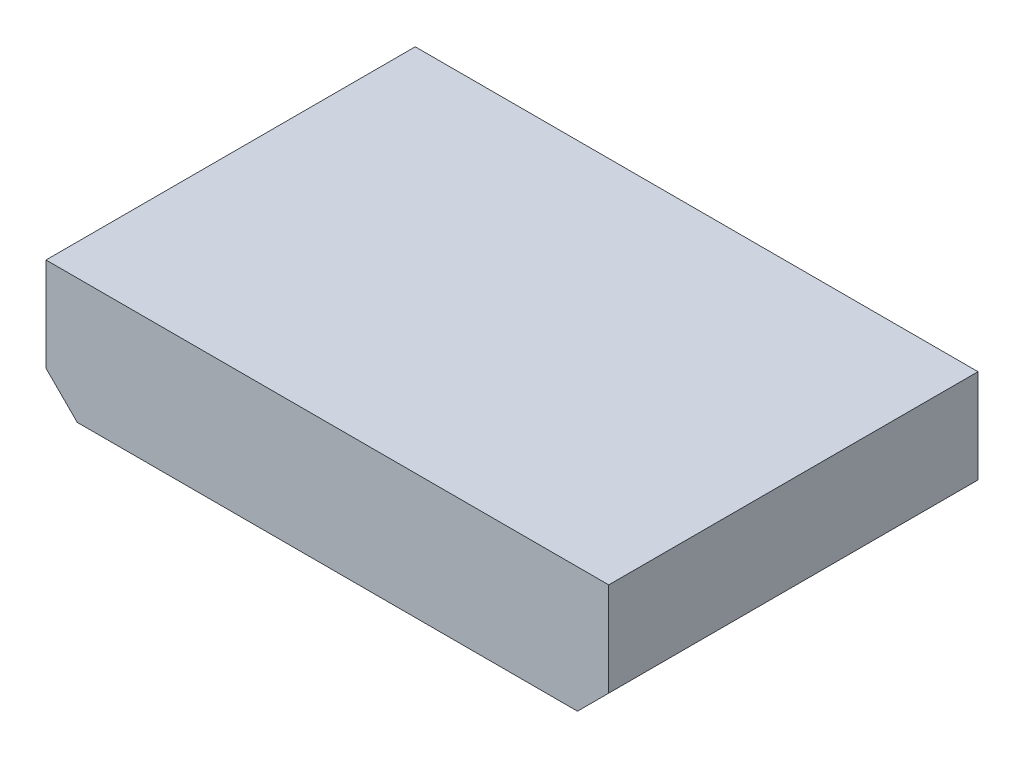
ISO-10303-21;
HEADER;
FILE_DESCRIPTION(('STEP AP214'),'2;1');
FILE_NAME('part.step','',(''),(''),'','','');
FILE_SCHEMA(('AUTOMOTIVE_DESIGN { 1 0 10303 214 1 1 1 1 }'));
ENDSEC;
DATA;
#1=APPLICATION_CONTEXT('core data for automotive mechanical design processes');
#2=APPLICATION_PROTOCOL_DEFINITION('international standard','automotive_design',2000,#1);
#3=PRODUCT_CONTEXT('',#1,'mechanical');
#4=PRODUCT('Part','Part','',(#3));
#5=PRODUCT_RELATED_PRODUCT_CATEGORY('part','',(#4));
#6=PRODUCT_DEFINITION_FORMATION('','',#4);
#7=PRODUCT_DEFINITION_CONTEXT('part definition',#1,'design');
#8=PRODUCT_DEFINITION('design','',#6,#7);
#9=PRODUCT_DEFINITION_SHAPE('','',#8);
#10=(LENGTH_UNIT() NAMED_UNIT(*) SI_UNIT(.MILLI.,.METRE.));
#11=(NAMED_UNIT(*) PLANE_ANGLE_UNIT() SI_UNIT($,.RADIAN.));
#12=(NAMED_UNIT(*) SI_UNIT($,.STERADIAN.) SOLID_ANGLE_UNIT());
#13=UNCERTAINTY_MEASURE_WITH_UNIT(LENGTH_MEASURE(1.E-05),#10,'distance_accuracy_value','');
#14=(GEOMETRIC_REPRESENTATION_CONTEXT(3) GLOBAL_UNCERTAINTY_ASSIGNED_CONTEXT((#13)) GLOBAL_UNIT_ASSIGNED_CONTEXT((#10,
#11,#12)) REPRESENTATION_CONTEXT('',''));
#15=CARTESIAN_POINT('',(0.,0.,0.));
#16=DIRECTION('',(0.,0.,1.));
#17=DIRECTION('',(1.,0.,0.));
#18=AXIS2_PLACEMENT_3D('',#15,#16,#17);
#19=CARTESIAN_POINT('',(12.7,0.,-2.));
#20=DIRECTION('',(0.,0.,1.));
#21=DIRECTION('',(1.,0.,0.));
#22=AXIS2_PLACEMENT_3D('',#19,#20,#21);
#23=CYLINDRICAL_SURFACE('',#22,0.25);
#24=CARTESIAN_POINT('',(12.7,0.,-2.));
#25=DIRECTION('',(0.,0.,1.));
#26=DIRECTION('',(1.,0.,0.));
#27=AXIS2_PLACEMENT_3D('',#24,#25,#26);
#28=CIRCLE('',#27,0.25);
#29=CARTESIAN_POINT('',(12.95,0.,-2.));
#30=VERTEX_POINT('',#29);
#31=EDGE_CURVE('E11',#30,#30,#28,.T.);
#32=ORIENTED_EDGE('',*,*,#31,.T.);
#33=EDGE_LOOP('',(#32));
#34=FACE_BOUND('',#33,.T.);
#35=CARTESIAN_POINT('',(12.7,0.,0.));
#36=DIRECTION('',(0.,0.,1.));
#37=DIRECTION('',(1.,0.,0.));
#38=AXIS2_PLACEMENT_3D('',#35,#36,#37);
#39=CIRCLE('',#38,0.25);
#40=CARTESIAN_POINT('',(12.95,0.,0.));
#41=VERTEX_POINT('',#40);
#42=EDGE_CURVE('E43',#41,#41,#39,.T.);
#43=ORIENTED_EDGE('',*,*,#42,.F.);
#44=EDGE_LOOP('',(#43));
#45=FACE_BOUND('',#44,.T.);
#46=ADVANCED_FACE('F40',(#34,#45),#23,.T.);
#47=CARTESIAN_POINT('',(12.7,0.,-2.));
#48=DIRECTION('',(0.,0.,1.));
#49=DIRECTION('',(1.,0.,0.));
#50=AXIS2_PLACEMENT_3D('',#47,#48,#49);
#51=PLANE('',#50);
#52=ORIENTED_EDGE('',*,*,#31,.F.);
#53=EDGE_LOOP('',(#52));
#54=FACE_BOUND('',#53,.T.);
#55=ADVANCED_FACE('F55',(#54),#51,.F.);
#56=CARTESIAN_POINT('',(12.7,0.,0.));
#57=DIRECTION('',(0.,0.,1.));
#58=DIRECTION('',(1.,0.,0.));
#59=AXIS2_PLACEMENT_3D('',#56,#57,#58);
#60=PLANE('',#59);
#61=ORIENTED_EDGE('',*,*,#42,.T.);
#62=EDGE_LOOP('',(#61));
#63=FACE_BOUND('',#62,.T.);
#64=ADVANCED_FACE('F52',(#63),#60,.T.);
#65=CLOSED_SHELL('',(#46,#55,#64));
#66=MANIFOLD_SOLID_BREP('B2',#65);
#67=CARTESIAN_POINT('',(10.16,0.,-2.));
#68=DIRECTION('',(0.,0.,1.));
#69=DIRECTION('',(1.,0.,0.));
#70=AXIS2_PLACEMENT_3D('',#67,#68,#69);
#71=CYLINDRICAL_SURFACE('',#70,0.25);
#72=CARTESIAN_POINT('',(10.16,0.,-2.));
#73=DIRECTION('',(0.,0.,1.));
#74=DIRECTION('',(1.,0.,0.));
#75=AXIS2_PLACEMENT_3D('',#72,#73,#74);
#76=CIRCLE('',#75,0.25);
#77=CARTESIAN_POINT('',(10.41,0.,-2.));
#78=VERTEX_POINT('',#77);
#79=EDGE_CURVE('E39',#78,#78,#76,.T.);
#80=ORIENTED_EDGE('',*,*,#79,.T.);
#81=EDGE_LOOP('',(#80));
#82=FACE_BOUND('',#81,.T.);
#83=CARTESIAN_POINT('',(10.16,0.,0.));
#84=DIRECTION('',(0.,0.,1.));
#85=DIRECTION('',(1.,0.,0.));
#86=AXIS2_PLACEMENT_3D('',#83,#84,#85);
#87=CIRCLE('',#86,0.25);
#88=CARTESIAN_POINT('',(10.41,0.,0.));
#89=VERTEX_POINT('',#88);
#90=EDGE_CURVE('E92',#89,#89,#87,.T.);
#91=ORIENTED_EDGE('',*,*,#90,.F.);
#92=EDGE_LOOP('',(#91));
#93=FACE_BOUND('',#92,.T.);
#94=ADVANCED_FACE('F89',(#82,#93),#71,.T.);
#95=CARTESIAN_POINT('',(10.16,0.,-2.));
#96=DIRECTION('',(0.,0.,1.));
#97=DIRECTION('',(1.,0.,0.));
#98=AXIS2_PLACEMENT_3D('',#95,#96,#97);
#99=PLANE('',#98);
#100=ORIENTED_EDGE('',*,*,#79,.F.);
#101=EDGE_LOOP('',(#100));
#102=FACE_BOUND('',#101,.T.);
#103=ADVANCED_FACE('F104',(#102),#99,.F.);
#104=CARTESIAN_POINT('',(10.16,0.,0.));
#105=DIRECTION('',(0.,0.,1.));
#106=DIRECTION('',(1.,0.,0.));
#107=AXIS2_PLACEMENT_3D('',#104,#105,#106);
#108=PLANE('',#107);
#109=ORIENTED_EDGE('',*,*,#90,.T.);
#110=EDGE_LOOP('',(#109));
#111=FACE_BOUND('',#110,.T.);
#112=ADVANCED_FACE('F101',(#111),#108,.T.);
#113=CLOSED_SHELL('',(#94,#103,#112));
#114=MANIFOLD_SOLID_BREP('B6',#113);
#115=CARTESIAN_POINT('',(7.62,0.,-2.));
#116=DIRECTION('',(0.,0.,1.));
#117=DIRECTION('',(1.,0.,0.));
#118=AXIS2_PLACEMENT_3D('',#115,#116,#117);
#119=CYLINDRICAL_SURFACE('',#118,0.25);
#120=CARTESIAN_POINT('',(7.62,0.,-2.));
#121=DIRECTION('',(0.,0.,1.));
#122=DIRECTION('',(1.,0.,0.));
#123=AXIS2_PLACEMENT_3D('',#120,#121,#122);
#124=CIRCLE('',#123,0.25);
#125=CARTESIAN_POINT('',(7.87,0.,-2.));
#126=VERTEX_POINT('',#125);
#127=EDGE_CURVE('E88',#126,#126,#124,.T.);
#128=ORIENTED_EDGE('',*,*,#127,.T.);
#129=EDGE_LOOP('',(#128));
#130=FACE_BOUND('',#129,.T.);
#131=CARTESIAN_POINT('',(7.62,0.,0.));
#132=DIRECTION('',(0.,0.,1.));
#133=DIRECTION('',(1.,0.,0.));
#134=AXIS2_PLACEMENT_3D('',#131,#132,#133);
#135=CIRCLE('',#134,0.25);
#136=CARTESIAN_POINT('',(7.87,0.,0.));
#137=VERTEX_POINT('',#136);
#138=EDGE_CURVE('E141',#137,#137,#135,.T.);
#139=ORIENTED_EDGE('',*,*,#138,.F.);
#140=EDGE_LOOP('',(#139));
#141=FACE_BOUND('',#140,.T.);
#142=ADVANCED_FACE('F138',(#130,#141),#119,.T.);
#143=CARTESIAN_POINT('',(7.62,0.,-2.));
#144=DIRECTION('',(0.,0.,1.));
#145=DIRECTION('',(1.,0.,0.));
#146=AXIS2_PLACEMENT_3D('',#143,#144,#145);
#147=PLANE('',#146);
#148=ORIENTED_EDGE('',*,*,#127,.F.);
#149=EDGE_LOOP('',(#148));
#150=FACE_BOUND('',#149,.T.);
#151=ADVANCED_FACE('F153',(#150),#147,.F.);
#152=CARTESIAN_POINT('',(7.62,0.,0.));
#153=DIRECTION('',(0.,0.,1.));
#154=DIRECTION('',(1.,0.,0.));
#155=AXIS2_PLACEMENT_3D('',#152,#153,#154);
#156=PLANE('',#155);
#157=ORIENTED_EDGE('',*,*,#138,.T.);
#158=EDGE_LOOP('',(#157));
#159=FACE_BOUND('',#158,.T.);
#160=ADVANCED_FACE('F150',(#159),#156,.T.);
#161=CLOSED_SHELL('',(#142,#151,#160));
#162=MANIFOLD_SOLID_BREP('B34',#161);
#163=CARTESIAN_POINT('',(5.08,0.,-2.));
#164=DIRECTION('',(0.,0.,1.));
#165=DIRECTION('',(1.,0.,0.));
#166=AXIS2_PLACEMENT_3D('',#163,#164,#165);
#167=CYLINDRICAL_SURFACE('',#166,0.25);
#168=CARTESIAN_POINT('',(5.08,0.,-2.));
#169=DIRECTION('',(0.,0.,1.));
#170=DIRECTION('',(1.,0.,0.));
#171=AXIS2_PLACEMENT_3D('',#168,#169,#170);
#172=CIRCLE('',#171,0.25);
#173=CARTESIAN_POINT('',(5.33,0.,-2.));
#174=VERTEX_POINT('',#173);
#175=EDGE_CURVE('E137',#174,#174,#172,.T.);
#176=ORIENTED_EDGE('',*,*,#175,.T.);
#177=EDGE_LOOP('',(#176));
#178=FACE_BOUND('',#177,.T.);
#179=CARTESIAN_POINT('',(5.08,0.,0.));
#180=DIRECTION('',(0.,0.,1.));
#181=DIRECTION('',(1.,0.,0.));
#182=AXIS2_PLACEMENT_3D('',#179,#180,#181);
#183=CIRCLE('',#182,0.25);
#184=CARTESIAN_POINT('',(5.33,0.,0.));
#185=VERTEX_POINT('',#184);
#186=EDGE_CURVE('E190',#185,#185,#183,.T.);
#187=ORIENTED_EDGE('',*,*,#186,.F.);
#188=EDGE_LOOP('',(#187));
#189=FACE_BOUND('',#188,.T.);
#190=ADVANCED_FACE('F187',(#178,#189),#167,.T.);
#191=CARTESIAN_POINT('',(5.08,0.,-2.));
#192=DIRECTION('',(0.,0.,1.));
#193=DIRECTION('',(1.,0.,0.));
#194=AXIS2_PLACEMENT_3D('',#191,#192,#193);
#195=PLANE('',#194);
#196=ORIENTED_EDGE('',*,*,#175,.F.);
#197=EDGE_LOOP('',(#196));
#198=FACE_BOUND('',#197,.T.);
#199=ADVANCED_FACE('F202',(#198),#195,.F.);
#200=CARTESIAN_POINT('',(5.08,0.,0.));
#201=DIRECTION('',(0.,0.,1.));
#202=DIRECTION('',(1.,0.,0.));
#203=AXIS2_PLACEMENT_3D('',#200,#201,#202);
#204=PLANE('',#203);
#205=ORIENTED_EDGE('',*,*,#186,.T.);
#206=EDGE_LOOP('',(#205));
#207=FACE_BOUND('',#206,.T.);
#208=ADVANCED_FACE('F199',(#207),#204,.T.);
#209=CLOSED_SHELL('',(#190,#199,#208));
#210=MANIFOLD_SOLID_BREP('B83',#209);
#211=CARTESIAN_POINT('',(2.54,0.,-2.));
#212=DIRECTION('',(0.,0.,1.));
#213=DIRECTION('',(1.,0.,0.));
#214=AXIS2_PLACEMENT_3D('',#211,#212,#213);
#215=CYLINDRICAL_SURFACE('',#214,0.25);
#216=CARTESIAN_POINT('',(2.54,0.,-2.));
#217=DIRECTION('',(0.,0.,1.));
#218=DIRECTION('',(1.,0.,0.));
#219=AXIS2_PLACEMENT_3D('',#216,#217,#218);
#220=CIRCLE('',#219,0.25);
#221=CARTESIAN_POINT('',(2.79,0.,-2.));
#222=VERTEX_POINT('',#221);
#223=EDGE_CURVE('E186',#222,#222,#220,.T.);
#224=ORIENTED_EDGE('',*,*,#223,.T.);
#225=EDGE_LOOP('',(#224));
#226=FACE_BOUND('',#225,.T.);
#227=CARTESIAN_POINT('',(2.54,0.,0.));
#228=DIRECTION('',(0.,0.,1.));
#229=DIRECTION('',(1.,0.,0.));
#230=AXIS2_PLACEMENT_3D('',#227,#228,#229);
#231=CIRCLE('',#230,0.25);
#232=CARTESIAN_POINT('',(2.79,0.,0.));
#233=VERTEX_POINT('',#232);
#234=EDGE_CURVE('E239',#233,#233,#231,.T.);
#235=ORIENTED_EDGE('',*,*,#234,.F.);
#236=EDGE_LOOP('',(#235));
#237=FACE_BOUND('',#236,.T.);
#238=ADVANCED_FACE('F236',(#226,#237),#215,.T.);
#239=CARTESIAN_POINT('',(2.54,0.,-2.));
#240=DIRECTION('',(0.,0.,1.));
#241=DIRECTION('',(1.,0.,0.));
#242=AXIS2_PLACEMENT_3D('',#239,#240,#241);
#243=PLANE('',#242);
#244=ORIENTED_EDGE('',*,*,#223,.F.);
#245=EDGE_LOOP('',(#244));
#246=FACE_BOUND('',#245,.T.);
#247=ADVANCED_FACE('F251',(#246),#243,.F.);
#248=CARTESIAN_POINT('',(2.54,0.,0.));
#249=DIRECTION('',(0.,0.,1.));
#250=DIRECTION('',(1.,0.,0.));
#251=AXIS2_PLACEMENT_3D('',#248,#249,#250);
#252=PLANE('',#251);
#253=ORIENTED_EDGE('',*,*,#234,.T.);
#254=EDGE_LOOP('',(#253));
#255=FACE_BOUND('',#254,.T.);
#256=ADVANCED_FACE('F248',(#255),#252,.T.);
#257=CLOSED_SHELL('',(#238,#247,#256));
#258=MANIFOLD_SOLID_BREP('B132',#257);
#259=CARTESIAN_POINT('',(0.,0.,-2.));
#260=DIRECTION('',(0.,0.,1.));
#261=DIRECTION('',(1.,0.,0.));
#262=AXIS2_PLACEMENT_3D('',#259,#260,#261);
#263=CYLINDRICAL_SURFACE('',#262,0.25);
#264=CARTESIAN_POINT('',(0.,0.,-2.));
#265=DIRECTION('',(0.,0.,1.));
#266=DIRECTION('',(1.,0.,0.));
#267=AXIS2_PLACEMENT_3D('',#264,#265,#266);
#268=CIRCLE('',#267,0.25);
#269=CARTESIAN_POINT('',(0.25,0.,-2.));
#270=VERTEX_POINT('',#269);
#271=EDGE_CURVE('E235',#270,#270,#268,.T.);
#272=ORIENTED_EDGE('',*,*,#271,.T.);
#273=EDGE_LOOP('',(#272));
#274=FACE_BOUND('',#273,.T.);
#275=CARTESIAN_POINT('',(0.,0.,0.));
#276=DIRECTION('',(0.,0.,1.));
#277=DIRECTION('',(1.,0.,0.));
#278=AXIS2_PLACEMENT_3D('',#275,#276,#277);
#279=CIRCLE('',#278,0.25);
#280=CARTESIAN_POINT('',(0.25,0.,0.));
#281=VERTEX_POINT('',#280);
#282=EDGE_CURVE('E289',#281,#281,#279,.T.);
#283=ORIENTED_EDGE('',*,*,#282,.F.);
#284=EDGE_LOOP('',(#283));
#285=FACE_BOUND('',#284,.T.);
#286=ADVANCED_FACE('F286',(#274,#285),#263,.T.);
#287=CARTESIAN_POINT('',(0.,0.,-2.));
#288=DIRECTION('',(0.,0.,1.));
#289=DIRECTION('',(1.,0.,0.));
#290=AXIS2_PLACEMENT_3D('',#287,#288,#289);
#291=PLANE('',#290);
#292=ORIENTED_EDGE('',*,*,#271,.F.);
#293=EDGE_LOOP('',(#292));
#294=FACE_BOUND('',#293,.T.);
#295=ADVANCED_FACE('F301',(#294),#291,.F.);
#296=CARTESIAN_POINT('',(0.,0.,0.));
#297=DIRECTION('',(0.,0.,1.));
#298=DIRECTION('',(1.,0.,0.));
#299=AXIS2_PLACEMENT_3D('',#296,#297,#298);
#300=PLANE('',#299);
#301=ORIENTED_EDGE('',*,*,#282,.T.);
#302=EDGE_LOOP('',(#301));
#303=FACE_BOUND('',#302,.T.);
#304=ADVANCED_FACE('F298',(#303),#300,.T.);
#305=CLOSED_SHELL('',(#286,#295,#304));
#306=MANIFOLD_SOLID_BREP('B181',#305);
#307=CARTESIAN_POINT('',(17.78,2.54,15.));
#308=DIRECTION('',(0.,-1.,0.));
#309=DIRECTION('',(0.,0.,-1.));
#310=AXIS2_PLACEMENT_3D('',#307,#308,#309);
#311=PLANE('',#310);
#312=DIRECTION('',(-1.,0.,0.));
#313=VECTOR('',#312,1.);
#314=CARTESIAN_POINT('',(17.78,2.54,0.));
#315=LINE('',#314,#313);
#316=CARTESIAN_POINT('',(17.78,2.54,0.));
#317=VERTEX_POINT('',#316);
#318=CARTESIAN_POINT('',(-5.08,2.54,0.));
#319=VERTEX_POINT('',#318);
#320=EDGE_CURVE('E411',#317,#319,#315,.T.);
#321=ORIENTED_EDGE('',*,*,#320,.T.);
#322=DIRECTION('',(0.,0.,-1.));
#323=VECTOR('',#322,1.);
#324=CARTESIAN_POINT('',(-5.08,2.54,15.));
#325=LINE('',#324,#323);
#326=CARTESIAN_POINT('',(-5.08,2.54,15.));
#327=VERTEX_POINT('',#326);
#328=EDGE_CURVE('E284',#327,#319,#325,.T.);
#329=ORIENTED_EDGE('',*,*,#328,.F.);
#330=DIRECTION('',(-1.,0.,0.));
#331=VECTOR('',#330,1.);
#332=CARTESIAN_POINT('',(17.78,2.54,15.));
#333=LINE('',#332,#331);
#334=CARTESIAN_POINT('',(17.78,2.54,15.));
#335=VERTEX_POINT('',#334);
#336=EDGE_CURVE('E421',#335,#327,#333,.T.);
#337=ORIENTED_EDGE('',*,*,#336,.F.);
#338=DIRECTION('',(0.,0.,-1.));
#339=VECTOR('',#338,1.);
#340=CARTESIAN_POINT('',(17.78,2.54,15.));
#341=LINE('',#340,#339);
#342=EDGE_CURVE('E407',#335,#317,#341,.T.);
#343=ORIENTED_EDGE('',*,*,#342,.T.);
#344=EDGE_LOOP('',(#321,#329,#337,#343));
#345=FACE_BOUND('',#344,.T.);
#346=ADVANCED_FACE('F327',(#345),#311,.F.);
#347=CARTESIAN_POINT('',(-5.08,2.54,15.));
#348=DIRECTION('',(1.,0.,0.));
#349=DIRECTION('',(0.,0.,-1.));
#350=AXIS2_PLACEMENT_3D('',#347,#348,#349);
#351=PLANE('',#350);
#352=DIRECTION('',(0.,-1.,0.));
#353=VECTOR('',#352,1.);
#354=CARTESIAN_POINT('',(-5.08,2.54,0.));
#355=LINE('',#354,#353);
#356=CARTESIAN_POINT('',(-5.08,-1.27,0.));
#357=VERTEX_POINT('',#356);
#358=EDGE_CURVE('E414',#319,#357,#355,.T.);
#359=ORIENTED_EDGE('',*,*,#358,.T.);
#360=DIRECTION('',(0.,0.,-1.));
#361=VECTOR('',#360,1.);
#362=CARTESIAN_POINT('',(-5.08,-1.27,15.));
#363=LINE('',#362,#361);
#364=CARTESIAN_POINT('',(-5.08,-1.27,15.));
#365=VERTEX_POINT('',#364);
#366=EDGE_CURVE('E335',#365,#357,#363,.T.);
#367=ORIENTED_EDGE('',*,*,#366,.F.);
#368=DIRECTION('',(0.,-1.,0.));
#369=VECTOR('',#368,1.);
#370=CARTESIAN_POINT('',(-5.08,2.54,15.));
#371=LINE('',#370,#369);
#372=EDGE_CURVE('E380',#327,#365,#371,.T.);
#373=ORIENTED_EDGE('',*,*,#372,.F.);
#374=ORIENTED_EDGE('',*,*,#328,.T.);
#375=EDGE_LOOP('',(#359,#367,#373,#374));
#376=FACE_BOUND('',#375,.T.);
#377=ADVANCED_FACE('F445',(#376),#351,.F.);
#378=CARTESIAN_POINT('',(-5.08,-1.27,15.));
#379=DIRECTION('',(0.707106781186547,0.707106781186548,0.));
#380=DIRECTION('',(-0.707106781186548,0.707106781186547,0.));
#381=AXIS2_PLACEMENT_3D('',#378,#379,#380);
#382=PLANE('',#381);
#383=DIRECTION('',(0.707106781186548,-0.707106781186547,0.));
#384=VECTOR('',#383,1.);
#385=CARTESIAN_POINT('',(-5.08,-1.27,0.));
#386=LINE('',#385,#384);
#387=CARTESIAN_POINT('',(-3.81,-2.54,0.));
#388=VERTEX_POINT('',#387);
#389=EDGE_CURVE('E416',#357,#388,#386,.T.);
#390=ORIENTED_EDGE('',*,*,#389,.T.);
#391=DIRECTION('',(0.,0.,-1.));
#392=VECTOR('',#391,1.);
#393=CARTESIAN_POINT('',(-3.81,-2.54,15.));
#394=LINE('',#393,#392);
#395=CARTESIAN_POINT('',(-3.81,-2.54,15.));
#396=VERTEX_POINT('',#395);
#397=EDGE_CURVE('E402',#396,#388,#394,.T.);
#398=ORIENTED_EDGE('',*,*,#397,.F.);
#399=DIRECTION('',(0.707106781186548,-0.707106781186547,0.));
#400=VECTOR('',#399,1.);
#401=CARTESIAN_POINT('',(-5.08,-1.27,15.));
#402=LINE('',#401,#400);
#403=EDGE_CURVE('E393',#365,#396,#402,.T.);
#404=ORIENTED_EDGE('',*,*,#403,.F.);
#405=ORIENTED_EDGE('',*,*,#366,.T.);
#406=EDGE_LOOP('',(#390,#398,#404,#405));
#407=FACE_BOUND('',#406,.T.);
#408=ADVANCED_FACE('F427',(#407),#382,.F.);
#409=CARTESIAN_POINT('',(-3.81,-2.54,15.));
#410=DIRECTION('',(0.,1.,0.));
#411=DIRECTION('',(0.,0.,1.));
#412=AXIS2_PLACEMENT_3D('',#409,#410,#411);
#413=PLANE('',#412);
#414=DIRECTION('',(1.,0.,0.));
#415=VECTOR('',#414,1.);
#416=CARTESIAN_POINT('',(-3.81,-2.54,0.));
#417=LINE('',#416,#415);
#418=CARTESIAN_POINT('',(16.51,-2.54,0.));
#419=VERTEX_POINT('',#418);
#420=EDGE_CURVE('E401',#388,#419,#417,.T.);
#421=ORIENTED_EDGE('',*,*,#420,.T.);
#422=DIRECTION('',(0.,0.,-1.));
#423=VECTOR('',#422,1.);
#424=CARTESIAN_POINT('',(16.51,-2.54,15.));
#425=LINE('',#424,#423);
#426=CARTESIAN_POINT('',(16.51,-2.54,15.));
#427=VERTEX_POINT('',#426);
#428=EDGE_CURVE('E398',#427,#419,#425,.T.);
#429=ORIENTED_EDGE('',*,*,#428,.F.);
#430=DIRECTION('',(1.,0.,0.));
#431=VECTOR('',#430,1.);
#432=CARTESIAN_POINT('',(-3.81,-2.54,15.));
#433=LINE('',#432,#431);
#434=EDGE_CURVE('E387',#396,#427,#433,.T.);
#435=ORIENTED_EDGE('',*,*,#434,.F.);
#436=ORIENTED_EDGE('',*,*,#397,.T.);
#437=EDGE_LOOP('',(#421,#429,#435,#436));
#438=FACE_BOUND('',#437,.T.);
#439=ADVANCED_FACE('F399',(#438),#413,.F.);
#440=CARTESIAN_POINT('',(16.51,-2.54,15.));
#441=DIRECTION('',(-0.707106781186547,0.707106781186548,0.));
#442=DIRECTION('',(-0.707106781186548,-0.707106781186547,0.));
#443=AXIS2_PLACEMENT_3D('',#440,#441,#442);
#444=PLANE('',#443);
#445=DIRECTION('',(0.707106781186548,0.707106781186547,0.));
#446=VECTOR('',#445,1.);
#447=CARTESIAN_POINT('',(16.51,-2.54,0.));
#448=LINE('',#447,#446);
#449=CARTESIAN_POINT('',(17.78,-1.27,0.));
#450=VERTEX_POINT('',#449);
#451=EDGE_CURVE('E366',#419,#450,#448,.T.);
#452=ORIENTED_EDGE('',*,*,#451,.T.);
#453=DIRECTION('',(0.,0.,-1.));
#454=VECTOR('',#453,1.);
#455=CARTESIAN_POINT('',(17.78,-1.27,15.));
#456=LINE('',#455,#454);
#457=CARTESIAN_POINT('',(17.78,-1.27,15.));
#458=VERTEX_POINT('',#457);
#459=EDGE_CURVE('E403',#458,#450,#456,.T.);
#460=ORIENTED_EDGE('',*,*,#459,.F.);
#461=DIRECTION('',(0.707106781186548,0.707106781186547,0.));
#462=VECTOR('',#461,1.);
#463=CARTESIAN_POINT('',(16.51,-2.54,15.));
#464=LINE('',#463,#462);
#465=EDGE_CURVE('E391',#427,#458,#464,.T.);
#466=ORIENTED_EDGE('',*,*,#465,.F.);
#467=ORIENTED_EDGE('',*,*,#428,.T.);
#468=EDGE_LOOP('',(#452,#460,#466,#467));
#469=FACE_BOUND('',#468,.T.);
#470=ADVANCED_FACE('F405',(#469),#444,.F.);
#471=CARTESIAN_POINT('',(17.78,-1.27,15.));
#472=DIRECTION('',(-1.,0.,0.));
#473=DIRECTION('',(0.,0.,1.));
#474=AXIS2_PLACEMENT_3D('',#471,#472,#473);
#475=PLANE('',#474);
#476=DIRECTION('',(0.,1.,0.));
#477=VECTOR('',#476,1.);
#478=CARTESIAN_POINT('',(17.78,-1.27,0.));
#479=LINE('',#478,#477);
#480=EDGE_CURVE('E372',#450,#317,#479,.T.);
#481=ORIENTED_EDGE('',*,*,#480,.T.);
#482=ORIENTED_EDGE('',*,*,#342,.F.);
#483=DIRECTION('',(0.,1.,0.));
#484=VECTOR('',#483,1.);
#485=CARTESIAN_POINT('',(17.78,-1.27,15.));
#486=LINE('',#485,#484);
#487=EDGE_CURVE('E343',#458,#335,#486,.T.);
#488=ORIENTED_EDGE('',*,*,#487,.F.);
#489=ORIENTED_EDGE('',*,*,#459,.T.);
#490=EDGE_LOOP('',(#481,#482,#488,#489));
#491=FACE_BOUND('',#490,.T.);
#492=ADVANCED_FACE('F434',(#491),#475,.F.);
#493=CARTESIAN_POINT('',(0.,0.,15.));
#494=DIRECTION('',(0.,0.,1.));
#495=DIRECTION('',(1.,0.,0.));
#496=AXIS2_PLACEMENT_3D('',#493,#494,#495);
#497=PLANE('',#496);
#498=ORIENTED_EDGE('',*,*,#336,.T.);
#499=ORIENTED_EDGE('',*,*,#372,.T.);
#500=ORIENTED_EDGE('',*,*,#403,.T.);
#501=ORIENTED_EDGE('',*,*,#434,.T.);
#502=ORIENTED_EDGE('',*,*,#465,.T.);
#503=ORIENTED_EDGE('',*,*,#487,.T.);
#504=EDGE_LOOP('',(#498,#499,#500,#501,#502,#503));
#505=FACE_BOUND('',#504,.T.);
#506=ADVANCED_FACE('F389',(#505),#497,.T.);
#507=CARTESIAN_POINT('',(0.,0.,0.));
#508=DIRECTION('',(0.,0.,1.));
#509=DIRECTION('',(1.,0.,0.));
#510=AXIS2_PLACEMENT_3D('',#507,#508,#509);
#511=PLANE('',#510);
#512=ORIENTED_EDGE('',*,*,#320,.F.);
#513=ORIENTED_EDGE('',*,*,#480,.F.);
#514=ORIENTED_EDGE('',*,*,#451,.F.);
#515=ORIENTED_EDGE('',*,*,#420,.F.);
#516=ORIENTED_EDGE('',*,*,#389,.F.);
#517=ORIENTED_EDGE('',*,*,#358,.F.);
#518=EDGE_LOOP('',(#512,#513,#514,#515,#516,#517));
#519=FACE_BOUND('',#518,.T.);
#520=ADVANCED_FACE('F430',(#519),#511,.F.);
#521=CLOSED_SHELL('',(#346,#377,#408,#439,#470,#492,#506,#520));
#522=MANIFOLD_SOLID_BREP('B230',#521);
#523=ADVANCED_BREP_SHAPE_REPRESENTATION('',(#18,#66,#114,#162,#210,#258,#306,#522),#14);
#524=SHAPE_DEFINITION_REPRESENTATION(#9,#523);
ENDSEC;
END-ISO-10303-21;
